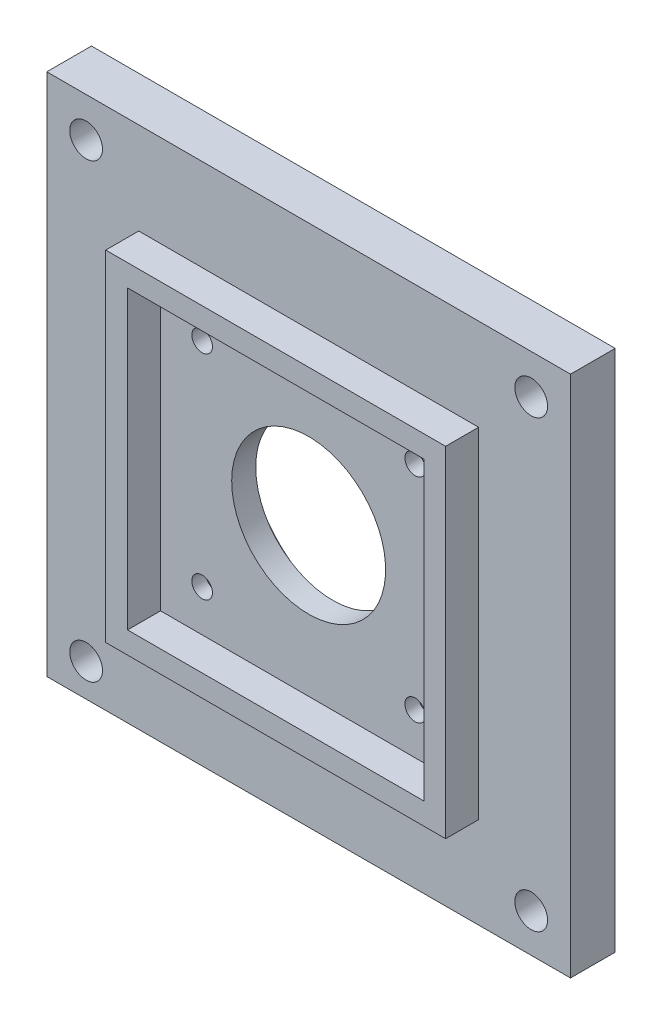
ISO-10303-21;
HEADER;
FILE_DESCRIPTION(('STEP AP214'),'2;1');
FILE_NAME('part.step','',(''),(''),'','','');
FILE_SCHEMA(('AUTOMOTIVE_DESIGN { 1 0 10303 214 1 1 1 1 }'));
ENDSEC;
DATA;
#1=APPLICATION_CONTEXT('core data for automotive mechanical design processes');
#2=APPLICATION_PROTOCOL_DEFINITION('international standard','automotive_design',2000,#1);
#3=PRODUCT_CONTEXT('',#1,'mechanical');
#4=PRODUCT('Part','Part','',(#3));
#5=PRODUCT_RELATED_PRODUCT_CATEGORY('part','',(#4));
#6=PRODUCT_DEFINITION_FORMATION('','',#4);
#7=PRODUCT_DEFINITION_CONTEXT('part definition',#1,'design');
#8=PRODUCT_DEFINITION('design','',#6,#7);
#9=PRODUCT_DEFINITION_SHAPE('','',#8);
#10=(LENGTH_UNIT() NAMED_UNIT(*) SI_UNIT(.MILLI.,.METRE.));
#11=(NAMED_UNIT(*) PLANE_ANGLE_UNIT() SI_UNIT($,.RADIAN.));
#12=(NAMED_UNIT(*) SI_UNIT($,.STERADIAN.) SOLID_ANGLE_UNIT());
#13=UNCERTAINTY_MEASURE_WITH_UNIT(LENGTH_MEASURE(1.E-05),#10,'distance_accuracy_value','');
#14=(GEOMETRIC_REPRESENTATION_CONTEXT(3) GLOBAL_UNCERTAINTY_ASSIGNED_CONTEXT((#13)) GLOBAL_UNIT_ASSIGNED_CONTEXT((#10,
#11,#12)) REPRESENTATION_CONTEXT('',''));
#15=CARTESIAN_POINT('',(0.,0.,0.));
#16=DIRECTION('',(0.,0.,1.));
#17=DIRECTION('',(1.,0.,0.));
#18=AXIS2_PLACEMENT_3D('',#15,#16,#17);
#19=CARTESIAN_POINT('',(-46.55,-4.26952432338381E-13,-6.5));
#20=DIRECTION('',(0.,0.,1.));
#21=DIRECTION('',(1.,0.,0.));
#22=AXIS2_PLACEMENT_3D('',#19,#20,#21);
#23=CYLINDRICAL_SURFACE('',#22,11.2);
#24=CARTESIAN_POINT('',(-46.55,-4.26952432338381E-13,0.));
#25=DIRECTION('',(0.,0.,-1.));
#26=DIRECTION('',(-1.,0.,0.));
#27=AXIS2_PLACEMENT_3D('',#24,#25,#26);
#28=CIRCLE('',#27,11.2);
#29=CARTESIAN_POINT('',(-57.75,-4.26952432338381E-13,0.));
#30=VERTEX_POINT('',#29);
#31=EDGE_CURVE('E137',#30,#30,#28,.T.);
#32=ORIENTED_EDGE('',*,*,#31,.F.);
#33=EDGE_LOOP('',(#32));
#34=FACE_BOUND('',#33,.T.);
#35=CARTESIAN_POINT('',(-46.55,-4.26952432338381E-13,-3.5));
#36=DIRECTION('',(0.,0.,-1.));
#37=DIRECTION('',(-1.,0.,0.));
#38=AXIS2_PLACEMENT_3D('',#35,#36,#37);
#39=CIRCLE('',#38,11.2);
#40=CARTESIAN_POINT('',(-57.75,-4.26952432338381E-13,-3.5));
#41=VERTEX_POINT('',#40);
#42=EDGE_CURVE('E37',#41,#41,#39,.T.);
#43=ORIENTED_EDGE('',*,*,#42,.T.);
#44=EDGE_LOOP('',(#43));
#45=FACE_BOUND('',#44,.T.);
#46=ADVANCED_FACE('F33',(#34,#45),#23,.F.);
#47=CARTESIAN_POINT('',(-31.05,15.4999999999996,-6.5));
#48=DIRECTION('',(0.,0.,1.));
#49=DIRECTION('',(1.,0.,0.));
#50=AXIS2_PLACEMENT_3D('',#47,#48,#49);
#51=CYLINDRICAL_SURFACE('',#50,1.5);
#52=CARTESIAN_POINT('',(-31.05,15.4999999999996,0.));
#53=DIRECTION('',(0.,0.,-1.));
#54=DIRECTION('',(-1.,0.,0.));
#55=AXIS2_PLACEMENT_3D('',#52,#53,#54);
#56=CIRCLE('',#55,1.5);
#57=CARTESIAN_POINT('',(-32.55,15.4999999999996,0.));
#58=VERTEX_POINT('',#57);
#59=EDGE_CURVE('E209',#58,#58,#56,.T.);
#60=ORIENTED_EDGE('',*,*,#59,.F.);
#61=EDGE_LOOP('',(#60));
#62=FACE_BOUND('',#61,.T.);
#63=CARTESIAN_POINT('',(-31.05,15.4999999999996,-3.));
#64=DIRECTION('',(0.,0.,-1.));
#65=DIRECTION('',(-1.,0.,0.));
#66=AXIS2_PLACEMENT_3D('',#63,#64,#65);
#67=CIRCLE('',#66,1.5);
#68=CARTESIAN_POINT('',(-32.55,15.4999999999996,-3.));
#69=VERTEX_POINT('',#68);
#70=EDGE_CURVE('E148',#69,#69,#67,.T.);
#71=ORIENTED_EDGE('',*,*,#70,.T.);
#72=EDGE_LOOP('',(#71));
#73=FACE_BOUND('',#72,.T.);
#74=ADVANCED_FACE('F308',(#62,#73),#51,.F.);
#75=CARTESIAN_POINT('',(-62.05,15.4999999999996,-6.5));
#76=DIRECTION('',(0.,0.,1.));
#77=DIRECTION('',(1.,0.,0.));
#78=AXIS2_PLACEMENT_3D('',#75,#76,#77);
#79=CYLINDRICAL_SURFACE('',#78,1.49999999999999);
#80=CARTESIAN_POINT('',(-62.05,15.4999999999996,0.));
#81=DIRECTION('',(0.,0.,-1.));
#82=DIRECTION('',(-1.,0.,0.));
#83=AXIS2_PLACEMENT_3D('',#80,#81,#82);
#84=CIRCLE('',#83,1.49999999999999);
#85=CARTESIAN_POINT('',(-63.55,15.4999999999996,0.));
#86=VERTEX_POINT('',#85);
#87=EDGE_CURVE('E212',#86,#86,#84,.T.);
#88=ORIENTED_EDGE('',*,*,#87,.F.);
#89=EDGE_LOOP('',(#88));
#90=FACE_BOUND('',#89,.T.);
#91=CARTESIAN_POINT('',(-62.05,15.4999999999996,-3.));
#92=DIRECTION('',(0.,0.,-1.));
#93=DIRECTION('',(-1.,0.,0.));
#94=AXIS2_PLACEMENT_3D('',#91,#92,#93);
#95=CIRCLE('',#94,1.49999999999999);
#96=CARTESIAN_POINT('',(-63.55,15.4999999999996,-3.));
#97=VERTEX_POINT('',#96);
#98=EDGE_CURVE('E144',#97,#97,#95,.T.);
#99=ORIENTED_EDGE('',*,*,#98,.T.);
#100=EDGE_LOOP('',(#99));
#101=FACE_BOUND('',#100,.T.);
#102=ADVANCED_FACE('F314',(#90,#101),#79,.F.);
#103=CARTESIAN_POINT('',(-31.05,-15.5000000000004,-6.5));
#104=DIRECTION('',(0.,0.,1.));
#105=DIRECTION('',(1.,0.,0.));
#106=AXIS2_PLACEMENT_3D('',#103,#104,#105);
#107=CYLINDRICAL_SURFACE('',#106,1.5);
#108=CARTESIAN_POINT('',(-31.05,-15.5000000000004,0.));
#109=DIRECTION('',(0.,0.,-1.));
#110=DIRECTION('',(-1.,0.,0.));
#111=AXIS2_PLACEMENT_3D('',#108,#109,#110);
#112=CIRCLE('',#111,1.5);
#113=CARTESIAN_POINT('',(-32.55,-15.5000000000004,0.));
#114=VERTEX_POINT('',#113);
#115=EDGE_CURVE('E201',#114,#114,#112,.T.);
#116=ORIENTED_EDGE('',*,*,#115,.F.);
#117=EDGE_LOOP('',(#116));
#118=FACE_BOUND('',#117,.T.);
#119=CARTESIAN_POINT('',(-31.05,-15.5000000000004,-2.));
#120=DIRECTION('',(0.,0.,-1.));
#121=DIRECTION('',(-1.,0.,0.));
#122=AXIS2_PLACEMENT_3D('',#119,#120,#121);
#123=CIRCLE('',#122,1.5);
#124=CARTESIAN_POINT('',(-32.55,-15.5000000000004,-2.));
#125=VERTEX_POINT('',#124);
#126=EDGE_CURVE('E139',#125,#125,#123,.T.);
#127=ORIENTED_EDGE('',*,*,#126,.T.);
#128=EDGE_LOOP('',(#127));
#129=FACE_BOUND('',#128,.T.);
#130=ADVANCED_FACE('F340',(#118,#129),#107,.F.);
#131=CARTESIAN_POINT('',(-62.05,-15.5000000000004,-6.5));
#132=DIRECTION('',(0.,0.,1.));
#133=DIRECTION('',(1.,0.,0.));
#134=AXIS2_PLACEMENT_3D('',#131,#132,#133);
#135=CYLINDRICAL_SURFACE('',#134,1.5);
#136=CARTESIAN_POINT('',(-62.05,-15.5000000000004,0.));
#137=DIRECTION('',(0.,0.,-1.));
#138=DIRECTION('',(-1.,0.,0.));
#139=AXIS2_PLACEMENT_3D('',#136,#137,#138);
#140=CIRCLE('',#139,1.5);
#141=CARTESIAN_POINT('',(-63.55,-15.5000000000004,0.));
#142=VERTEX_POINT('',#141);
#143=EDGE_CURVE('E206',#142,#142,#140,.T.);
#144=ORIENTED_EDGE('',*,*,#143,.F.);
#145=EDGE_LOOP('',(#144));
#146=FACE_BOUND('',#145,.T.);
#147=CARTESIAN_POINT('',(-62.05,-15.5000000000004,-2.));
#148=DIRECTION('',(0.,0.,-1.));
#149=DIRECTION('',(-1.,0.,0.));
#150=AXIS2_PLACEMENT_3D('',#147,#148,#149);
#151=CIRCLE('',#150,1.5);
#152=CARTESIAN_POINT('',(-63.55,-15.5000000000004,-2.));
#153=VERTEX_POINT('',#152);
#154=EDGE_CURVE('E134',#153,#153,#151,.T.);
#155=ORIENTED_EDGE('',*,*,#154,.T.);
#156=EDGE_LOOP('',(#155));
#157=FACE_BOUND('',#156,.T.);
#158=ADVANCED_FACE('F343',(#146,#157),#135,.F.);
#159=CARTESIAN_POINT('',(-21.825,24.7249999999995,4.8));
#160=DIRECTION('',(0.,0.,-1.));
#161=DIRECTION('',(-1.,0.,0.));
#162=AXIS2_PLACEMENT_3D('',#159,#160,#161);
#163=PLANE('',#162);
#164=DIRECTION('',(-1.,0.,0.));
#165=VECTOR('',#164,1.);
#166=CARTESIAN_POINT('',(-71.275,24.7249999999995,4.8));
#167=LINE('',#166,#165);
#168=CARTESIAN_POINT('',(-21.825,24.7249999999995,4.8));
#169=VERTEX_POINT('',#168);
#170=CARTESIAN_POINT('',(-71.275,24.7249999999995,4.8));
#171=VERTEX_POINT('',#170);
#172=EDGE_CURVE('E104',#169,#171,#167,.T.);
#173=ORIENTED_EDGE('',*,*,#172,.T.);
#174=DIRECTION('',(0.,-1.,0.));
#175=VECTOR('',#174,1.);
#176=CARTESIAN_POINT('',(-71.275,-24.7250000000005,4.8));
#177=LINE('',#176,#175);
#178=CARTESIAN_POINT('',(-71.275,-24.7250000000005,4.8));
#179=VERTEX_POINT('',#178);
#180=EDGE_CURVE('E96',#171,#179,#177,.T.);
#181=ORIENTED_EDGE('',*,*,#180,.T.);
#182=DIRECTION('',(1.,0.,0.));
#183=VECTOR('',#182,1.);
#184=CARTESIAN_POINT('',(-21.825,-24.7250000000004,4.8));
#185=LINE('',#184,#183);
#186=CARTESIAN_POINT('',(-21.825,-24.7250000000004,4.8));
#187=VERTEX_POINT('',#186);
#188=EDGE_CURVE('E101',#179,#187,#185,.T.);
#189=ORIENTED_EDGE('',*,*,#188,.T.);
#190=DIRECTION('',(0.,1.,0.));
#191=VECTOR('',#190,1.);
#192=CARTESIAN_POINT('',(-21.825,24.7249999999995,4.8));
#193=LINE('',#192,#191);
#194=EDGE_CURVE('E59',#187,#169,#193,.T.);
#195=ORIENTED_EDGE('',*,*,#194,.T.);
#196=EDGE_LOOP('',(#173,#181,#189,#195));
#197=FACE_BOUND('',#196,.T.);
#198=DIRECTION('',(1.,0.,0.));
#199=VECTOR('',#198,1.);
#200=CARTESIAN_POINT('',(-68.1,-21.5500000000005,4.8));
#201=LINE('',#200,#199);
#202=CARTESIAN_POINT('',(-68.1,-21.5500000000005,4.8));
#203=VERTEX_POINT('',#202);
#204=CARTESIAN_POINT('',(-25.,-21.5500000000004,4.8));
#205=VERTEX_POINT('',#204);
#206=EDGE_CURVE('E252',#203,#205,#201,.T.);
#207=ORIENTED_EDGE('',*,*,#206,.F.);
#208=DIRECTION('',(0.,-1.,0.));
#209=VECTOR('',#208,1.);
#210=CARTESIAN_POINT('',(-68.1,21.5499999999995,4.8));
#211=LINE('',#210,#209);
#212=CARTESIAN_POINT('',(-68.1,21.5499999999995,4.8));
#213=VERTEX_POINT('',#212);
#214=EDGE_CURVE('E80',#213,#203,#211,.T.);
#215=ORIENTED_EDGE('',*,*,#214,.F.);
#216=DIRECTION('',(-1.,0.,0.));
#217=VECTOR('',#216,1.);
#218=CARTESIAN_POINT('',(-25.,21.5499999999995,4.8));
#219=LINE('',#218,#217);
#220=CARTESIAN_POINT('',(-25.,21.5499999999995,4.8));
#221=VERTEX_POINT('',#220);
#222=EDGE_CURVE('E258',#221,#213,#219,.T.);
#223=ORIENTED_EDGE('',*,*,#222,.F.);
#224=DIRECTION('',(0.,1.,0.));
#225=VECTOR('',#224,1.);
#226=CARTESIAN_POINT('',(-25.,-21.5500000000004,4.8));
#227=LINE('',#226,#225);
#228=EDGE_CURVE('E255',#205,#221,#227,.T.);
#229=ORIENTED_EDGE('',*,*,#228,.F.);
#230=EDGE_LOOP('',(#207,#215,#223,#229));
#231=FACE_BOUND('',#230,.T.);
#232=ADVANCED_FACE('F98',(#197,#231),#163,.F.);
#233=CARTESIAN_POINT('',(-71.275,24.7249999999995,4.8));
#234=DIRECTION('',(0.,-1.,0.));
#235=DIRECTION('',(1.,0.,0.));
#236=AXIS2_PLACEMENT_3D('',#233,#234,#235);
#237=PLANE('',#236);
#238=DIRECTION('',(-1.,0.,0.));
#239=VECTOR('',#238,1.);
#240=CARTESIAN_POINT('',(-71.275,24.7249999999995,0.));
#241=LINE('',#240,#239);
#242=CARTESIAN_POINT('',(-21.825,24.7249999999995,0.));
#243=VERTEX_POINT('',#242);
#244=CARTESIAN_POINT('',(-71.275,24.7249999999995,0.));
#245=VERTEX_POINT('',#244);
#246=EDGE_CURVE('E72',#243,#245,#241,.T.);
#247=ORIENTED_EDGE('',*,*,#246,.T.);
#248=DIRECTION('',(0.,0.,-1.));
#249=VECTOR('',#248,1.);
#250=CARTESIAN_POINT('',(-71.275,24.7249999999995,4.8));
#251=LINE('',#250,#249);
#252=EDGE_CURVE('E11',#171,#245,#251,.T.);
#253=ORIENTED_EDGE('',*,*,#252,.F.);
#254=ORIENTED_EDGE('',*,*,#172,.F.);
#255=DIRECTION('',(0.,0.,-1.));
#256=VECTOR('',#255,1.);
#257=CARTESIAN_POINT('',(-21.825,24.7249999999995,4.8));
#258=LINE('',#257,#256);
#259=EDGE_CURVE('E120',#169,#243,#258,.T.);
#260=ORIENTED_EDGE('',*,*,#259,.T.);
#261=EDGE_LOOP('',(#247,#253,#254,#260));
#262=FACE_BOUND('',#261,.T.);
#263=ADVANCED_FACE('F35',(#262),#237,.F.);
#264=CARTESIAN_POINT('',(-71.275,-24.7250000000005,4.8));
#265=DIRECTION('',(1.,0.,0.));
#266=DIRECTION('',(0.,1.,0.));
#267=AXIS2_PLACEMENT_3D('',#264,#265,#266);
#268=PLANE('',#267);
#269=DIRECTION('',(0.,-1.,0.));
#270=VECTOR('',#269,1.);
#271=CARTESIAN_POINT('',(-71.275,-24.7250000000005,0.));
#272=LINE('',#271,#270);
#273=CARTESIAN_POINT('',(-71.275,-24.7250000000005,0.));
#274=VERTEX_POINT('',#273);
#275=EDGE_CURVE('E112',#245,#274,#272,.T.);
#276=ORIENTED_EDGE('',*,*,#275,.T.);
#277=DIRECTION('',(0.,0.,-1.));
#278=VECTOR('',#277,1.);
#279=CARTESIAN_POINT('',(-71.275,-24.7250000000005,4.8));
#280=LINE('',#279,#278);
#281=EDGE_CURVE('E42',#179,#274,#280,.T.);
#282=ORIENTED_EDGE('',*,*,#281,.F.);
#283=ORIENTED_EDGE('',*,*,#180,.F.);
#284=ORIENTED_EDGE('',*,*,#252,.T.);
#285=EDGE_LOOP('',(#276,#282,#283,#284));
#286=FACE_BOUND('',#285,.T.);
#287=ADVANCED_FACE('F110',(#286),#268,.F.);
#288=CARTESIAN_POINT('',(-21.825,-24.7250000000004,4.8));
#289=DIRECTION('',(0.,1.,0.));
#290=DIRECTION('',(-1.,0.,0.));
#291=AXIS2_PLACEMENT_3D('',#288,#289,#290);
#292=PLANE('',#291);
#293=DIRECTION('',(1.,0.,0.));
#294=VECTOR('',#293,1.);
#295=CARTESIAN_POINT('',(-21.825,-24.7250000000004,0.));
#296=LINE('',#295,#294);
#297=CARTESIAN_POINT('',(-21.825,-24.7250000000004,0.));
#298=VERTEX_POINT('',#297);
#299=EDGE_CURVE('E127',#274,#298,#296,.T.);
#300=ORIENTED_EDGE('',*,*,#299,.T.);
#301=DIRECTION('',(0.,0.,-1.));
#302=VECTOR('',#301,1.);
#303=CARTESIAN_POINT('',(-21.825,-24.7250000000004,4.8));
#304=LINE('',#303,#302);
#305=EDGE_CURVE('E115',#187,#298,#304,.T.);
#306=ORIENTED_EDGE('',*,*,#305,.F.);
#307=ORIENTED_EDGE('',*,*,#188,.F.);
#308=ORIENTED_EDGE('',*,*,#281,.T.);
#309=EDGE_LOOP('',(#300,#306,#307,#308));
#310=FACE_BOUND('',#309,.T.);
#311=ADVANCED_FACE('F117',(#310),#292,.F.);
#312=CARTESIAN_POINT('',(-21.825,24.7249999999995,4.8));
#313=DIRECTION('',(-1.,0.,0.));
#314=DIRECTION('',(0.,-1.,0.));
#315=AXIS2_PLACEMENT_3D('',#312,#313,#314);
#316=PLANE('',#315);
#317=DIRECTION('',(0.,1.,0.));
#318=VECTOR('',#317,1.);
#319=CARTESIAN_POINT('',(-21.825,24.7249999999995,0.));
#320=LINE('',#319,#318);
#321=EDGE_CURVE('E129',#298,#243,#320,.T.);
#322=ORIENTED_EDGE('',*,*,#321,.T.);
#323=ORIENTED_EDGE('',*,*,#259,.F.);
#324=ORIENTED_EDGE('',*,*,#194,.F.);
#325=ORIENTED_EDGE('',*,*,#305,.T.);
#326=EDGE_LOOP('',(#322,#323,#324,#325));
#327=FACE_BOUND('',#326,.T.);
#328=ADVANCED_FACE('F400',(#327),#316,.F.);
#329=CARTESIAN_POINT('',(-68.1,-21.5500000000005,4.8));
#330=DIRECTION('',(0.,1.,0.));
#331=DIRECTION('',(-1.,0.,0.));
#332=AXIS2_PLACEMENT_3D('',#329,#330,#331);
#333=PLANE('',#332);
#334=DIRECTION('',(1.,0.,0.));
#335=VECTOR('',#334,1.);
#336=CARTESIAN_POINT('',(-68.1,-21.5500000000005,0.));
#337=LINE('',#336,#335);
#338=CARTESIAN_POINT('',(-68.1,-21.5500000000005,0.));
#339=VERTEX_POINT('',#338);
#340=CARTESIAN_POINT('',(-25.,-21.5500000000004,0.));
#341=VERTEX_POINT('',#340);
#342=EDGE_CURVE('E251',#339,#341,#337,.T.);
#343=ORIENTED_EDGE('',*,*,#342,.F.);
#344=DIRECTION('',(0.,0.,-1.));
#345=VECTOR('',#344,1.);
#346=CARTESIAN_POINT('',(-68.1,-21.5500000000005,4.8));
#347=LINE('',#346,#345);
#348=EDGE_CURVE('E261',#203,#339,#347,.T.);
#349=ORIENTED_EDGE('',*,*,#348,.F.);
#350=ORIENTED_EDGE('',*,*,#206,.T.);
#351=DIRECTION('',(0.,0.,-1.));
#352=VECTOR('',#351,1.);
#353=CARTESIAN_POINT('',(-25.,-21.5500000000004,4.8));
#354=LINE('',#353,#352);
#355=EDGE_CURVE('E125',#205,#341,#354,.T.);
#356=ORIENTED_EDGE('',*,*,#355,.T.);
#357=EDGE_LOOP('',(#343,#349,#350,#356));
#358=FACE_BOUND('',#357,.T.);
#359=ADVANCED_FACE('F280',(#358),#333,.T.);
#360=CARTESIAN_POINT('',(-25.,-21.5500000000004,4.8));
#361=DIRECTION('',(-1.,0.,0.));
#362=DIRECTION('',(0.,0.,1.));
#363=AXIS2_PLACEMENT_3D('',#360,#361,#362);
#364=PLANE('',#363);
#365=DIRECTION('',(0.,1.,0.));
#366=VECTOR('',#365,1.);
#367=CARTESIAN_POINT('',(-25.,-21.5500000000004,0.));
#368=LINE('',#367,#366);
#369=CARTESIAN_POINT('',(-25.,21.5499999999995,0.));
#370=VERTEX_POINT('',#369);
#371=EDGE_CURVE('E264',#341,#370,#368,.T.);
#372=ORIENTED_EDGE('',*,*,#371,.F.);
#373=ORIENTED_EDGE('',*,*,#355,.F.);
#374=ORIENTED_EDGE('',*,*,#228,.T.);
#375=DIRECTION('',(0.,0.,-1.));
#376=VECTOR('',#375,1.);
#377=CARTESIAN_POINT('',(-25.,21.5499999999995,4.8));
#378=LINE('',#377,#376);
#379=EDGE_CURVE('E274',#221,#370,#378,.T.);
#380=ORIENTED_EDGE('',*,*,#379,.T.);
#381=EDGE_LOOP('',(#372,#373,#374,#380));
#382=FACE_BOUND('',#381,.T.);
#383=ADVANCED_FACE('F295',(#382),#364,.T.);
#384=CARTESIAN_POINT('',(-25.,21.5499999999995,4.8));
#385=DIRECTION('',(0.,-1.,0.));
#386=DIRECTION('',(1.,0.,0.));
#387=AXIS2_PLACEMENT_3D('',#384,#385,#386);
#388=PLANE('',#387);
#389=DIRECTION('',(-1.,0.,0.));
#390=VECTOR('',#389,1.);
#391=CARTESIAN_POINT('',(-25.,21.5499999999995,0.));
#392=LINE('',#391,#390);
#393=CARTESIAN_POINT('',(-68.1,21.5499999999995,0.));
#394=VERTEX_POINT('',#393);
#395=EDGE_CURVE('E267',#370,#394,#392,.T.);
#396=ORIENTED_EDGE('',*,*,#395,.F.);
#397=ORIENTED_EDGE('',*,*,#379,.F.);
#398=ORIENTED_EDGE('',*,*,#222,.T.);
#399=DIRECTION('',(0.,0.,-1.));
#400=VECTOR('',#399,1.);
#401=CARTESIAN_POINT('',(-68.1,21.5499999999995,4.8));
#402=LINE('',#401,#400);
#403=EDGE_CURVE('E50',#213,#394,#402,.T.);
#404=ORIENTED_EDGE('',*,*,#403,.T.);
#405=EDGE_LOOP('',(#396,#397,#398,#404));
#406=FACE_BOUND('',#405,.T.);
#407=ADVANCED_FACE('F297',(#406),#388,.T.);
#408=CARTESIAN_POINT('',(-68.1,21.5499999999995,4.8));
#409=DIRECTION('',(1.,0.,0.));
#410=DIRECTION('',(0.,0.,-1.));
#411=AXIS2_PLACEMENT_3D('',#408,#409,#410);
#412=PLANE('',#411);
#413=DIRECTION('',(0.,-1.,0.));
#414=VECTOR('',#413,1.);
#415=CARTESIAN_POINT('',(-68.1,21.5499999999995,0.));
#416=LINE('',#415,#414);
#417=EDGE_CURVE('E256',#394,#339,#416,.T.);
#418=ORIENTED_EDGE('',*,*,#417,.F.);
#419=ORIENTED_EDGE('',*,*,#403,.F.);
#420=ORIENTED_EDGE('',*,*,#214,.T.);
#421=ORIENTED_EDGE('',*,*,#348,.T.);
#422=EDGE_LOOP('',(#418,#419,#420,#421));
#423=FACE_BOUND('',#422,.T.);
#424=ADVANCED_FACE('F292',(#423),#412,.T.);
#425=CARTESIAN_POINT('',(-8.44999999999996,38.0999999999996,0.));
#426=DIRECTION('',(0.,0.,-1.));
#427=DIRECTION('',(-1.,0.,0.));
#428=AXIS2_PLACEMENT_3D('',#425,#426,#427);
#429=PLANE('',#428);
#430=CARTESIAN_POINT('',(-14.17,-32.3800000000004,0.));
#431=DIRECTION('',(0.,0.,-1.));
#432=DIRECTION('',(-1.,0.,0.));
#433=AXIS2_PLACEMENT_3D('',#430,#431,#432);
#434=CIRCLE('',#433,2.38125);
#435=CARTESIAN_POINT('',(-16.55125,-32.3800000000004,0.));
#436=VERTEX_POINT('',#435);
#437=EDGE_CURVE('E179',#436,#436,#434,.T.);
#438=ORIENTED_EDGE('',*,*,#437,.T.);
#439=EDGE_LOOP('',(#438));
#440=FACE_BOUND('',#439,.T.);
#441=CARTESIAN_POINT('',(-78.93,32.3799999999996,0.));
#442=DIRECTION('',(0.,0.,-1.));
#443=DIRECTION('',(-1.,0.,0.));
#444=AXIS2_PLACEMENT_3D('',#441,#442,#443);
#445=CIRCLE('',#444,2.38125);
#446=CARTESIAN_POINT('',(-81.31125,32.3799999999996,0.));
#447=VERTEX_POINT('',#446);
#448=EDGE_CURVE('E189',#447,#447,#445,.T.);
#449=ORIENTED_EDGE('',*,*,#448,.T.);
#450=EDGE_LOOP('',(#449));
#451=FACE_BOUND('',#450,.T.);
#452=DIRECTION('',(1.,0.,0.));
#453=VECTOR('',#452,1.);
#454=CARTESIAN_POINT('',(-84.65,38.0999999999996,0.));
#455=LINE('',#454,#453);
#456=CARTESIAN_POINT('',(-84.65,38.0999999999996,0.));
#457=VERTEX_POINT('',#456);
#458=CARTESIAN_POINT('',(-8.44999999999996,38.0999999999996,0.));
#459=VERTEX_POINT('',#458);
#460=EDGE_CURVE('E215',#457,#459,#455,.T.);
#461=ORIENTED_EDGE('',*,*,#460,.F.);
#462=DIRECTION('',(0.,1.,0.));
#463=VECTOR('',#462,1.);
#464=CARTESIAN_POINT('',(-84.65,-38.1000000000004,0.));
#465=LINE('',#464,#463);
#466=CARTESIAN_POINT('',(-84.65,-38.1000000000004,0.));
#467=VERTEX_POINT('',#466);
#468=EDGE_CURVE('E220',#467,#457,#465,.T.);
#469=ORIENTED_EDGE('',*,*,#468,.F.);
#470=DIRECTION('',(-0.999998900596113,-0.001482837335923,0.));
#471=VECTOR('',#470,1.);
#472=CARTESIAN_POINT('',(-8.45,-37.9870076707789,0.));
#473=LINE('',#472,#471);
#474=CARTESIAN_POINT('',(-8.45,-37.9870076707789,0.));
#475=VERTEX_POINT('',#474);
#476=EDGE_CURVE('E235',#475,#467,#473,.T.);
#477=ORIENTED_EDGE('',*,*,#476,.F.);
#478=DIRECTION('',(0.,-1.,0.));
#479=VECTOR('',#478,1.);
#480=CARTESIAN_POINT('',(-8.44999999999996,38.0999999999996,0.));
#481=LINE('',#480,#479);
#482=EDGE_CURVE('E232',#459,#475,#481,.T.);
#483=ORIENTED_EDGE('',*,*,#482,.F.);
#484=EDGE_LOOP('',(#461,#469,#477,#483));
#485=FACE_BOUND('',#484,.T.);
#486=CARTESIAN_POINT('',(-14.17,32.3799999999996,0.));
#487=DIRECTION('',(0.,0.,-1.));
#488=DIRECTION('',(-1.,0.,0.));
#489=AXIS2_PLACEMENT_3D('',#486,#487,#488);
#490=CIRCLE('',#489,2.38125);
#491=CARTESIAN_POINT('',(-16.55125,32.3799999999996,0.));
#492=VERTEX_POINT('',#491);
#493=EDGE_CURVE('E195',#492,#492,#490,.T.);
#494=ORIENTED_EDGE('',*,*,#493,.T.);
#495=EDGE_LOOP('',(#494));
#496=FACE_BOUND('',#495,.T.);
#497=CARTESIAN_POINT('',(-78.93,-33.3093949292618,0.));
#498=DIRECTION('',(0.,0.,-1.));
#499=DIRECTION('',(-1.,0.,0.));
#500=AXIS2_PLACEMENT_3D('',#497,#498,#499);
#501=CIRCLE('',#500,2.38125);
#502=CARTESIAN_POINT('',(-81.31125,-33.3093949292618,0.));
#503=VERTEX_POINT('',#502);
#504=EDGE_CURVE('E183',#503,#503,#501,.T.);
#505=ORIENTED_EDGE('',*,*,#504,.T.);
#506=EDGE_LOOP('',(#505));
#507=FACE_BOUND('',#506,.T.);
#508=ORIENTED_EDGE('',*,*,#275,.F.);
#509=ORIENTED_EDGE('',*,*,#246,.F.);
#510=ORIENTED_EDGE('',*,*,#321,.F.);
#511=ORIENTED_EDGE('',*,*,#299,.F.);
#512=EDGE_LOOP('',(#508,#509,#510,#511));
#513=FACE_BOUND('',#512,.T.);
#514=ADVANCED_FACE('F304',(#440,#451,#485,#496,#507,#513),#429,.F.);
#515=CARTESIAN_POINT('',(-8.44999999999996,38.0999999999996,-6.5));
#516=DIRECTION('',(0.,0.,-1.));
#517=DIRECTION('',(-1.,0.,0.));
#518=AXIS2_PLACEMENT_3D('',#515,#516,#517);
#519=PLANE('',#518);
#520=CARTESIAN_POINT('',(-46.55,-4.19803081186387E-13,-6.5));
#521=DIRECTION('',(0.,0.,-1.));
#522=DIRECTION('',(-1.,0.,0.));
#523=AXIS2_PLACEMENT_3D('',#520,#521,#522);
#524=CIRCLE('',#523,15.3625);
#525=CARTESIAN_POINT('',(-61.9125,-4.19803081186387E-13,-6.5));
#526=VERTEX_POINT('',#525);
#527=EDGE_CURVE('E164',#526,#526,#524,.T.);
#528=ORIENTED_EDGE('',*,*,#527,.F.);
#529=EDGE_LOOP('',(#528));
#530=FACE_BOUND('',#529,.T.);
#531=CARTESIAN_POINT('',(-31.05,15.4999999999996,-6.5));
#532=DIRECTION('',(0.,0.,-1.));
#533=DIRECTION('',(-1.,0.,0.));
#534=AXIS2_PLACEMENT_3D('',#531,#532,#533);
#535=CIRCLE('',#534,5.99999999999999);
#536=CARTESIAN_POINT('',(-37.05,15.4999999999996,-6.5));
#537=VERTEX_POINT('',#536);
#538=EDGE_CURVE('E157',#537,#537,#535,.T.);
#539=ORIENTED_EDGE('',*,*,#538,.F.);
#540=EDGE_LOOP('',(#539));
#541=FACE_BOUND('',#540,.T.);
#542=CARTESIAN_POINT('',(-62.05,15.4999999999996,-6.5));
#543=DIRECTION('',(0.,0.,-1.));
#544=DIRECTION('',(-1.,0.,0.));
#545=AXIS2_PLACEMENT_3D('',#542,#543,#544);
#546=CIRCLE('',#545,5.99999999999999);
#547=CARTESIAN_POINT('',(-68.05,15.4999999999996,-6.5));
#548=VERTEX_POINT('',#547);
#549=EDGE_CURVE('E150',#548,#548,#546,.T.);
#550=ORIENTED_EDGE('',*,*,#549,.F.);
#551=EDGE_LOOP('',(#550));
#552=FACE_BOUND('',#551,.T.);
#553=CARTESIAN_POINT('',(-31.05,-15.5000000000004,-6.5));
#554=DIRECTION('',(0.,0.,-1.));
#555=DIRECTION('',(-1.,0.,0.));
#556=AXIS2_PLACEMENT_3D('',#553,#554,#555);
#557=CIRCLE('',#556,6.);
#558=CARTESIAN_POINT('',(-37.05,-15.5000000000004,-6.5));
#559=VERTEX_POINT('',#558);
#560=EDGE_CURVE('E146',#559,#559,#557,.T.);
#561=ORIENTED_EDGE('',*,*,#560,.F.);
#562=EDGE_LOOP('',(#561));
#563=FACE_BOUND('',#562,.T.);
#564=CARTESIAN_POINT('',(-62.05,-15.5000000000004,-6.5));
#565=DIRECTION('',(0.,0.,-1.));
#566=DIRECTION('',(-1.,0.,0.));
#567=AXIS2_PLACEMENT_3D('',#564,#565,#566);
#568=CIRCLE('',#567,6.);
#569=CARTESIAN_POINT('',(-68.05,-15.5000000000004,-6.5));
#570=VERTEX_POINT('',#569);
#571=EDGE_CURVE('E142',#570,#570,#568,.T.);
#572=ORIENTED_EDGE('',*,*,#571,.F.);
#573=EDGE_LOOP('',(#572));
#574=FACE_BOUND('',#573,.T.);
#575=CARTESIAN_POINT('',(-14.17,-32.3800000000004,-6.5));
#576=DIRECTION('',(0.,0.,-1.));
#577=DIRECTION('',(-1.,0.,0.));
#578=AXIS2_PLACEMENT_3D('',#575,#576,#577);
#579=CIRCLE('',#578,2.38125);
#580=CARTESIAN_POINT('',(-16.55125,-32.3800000000004,-6.5));
#581=VERTEX_POINT('',#580);
#582=EDGE_CURVE('E180',#581,#581,#579,.T.);
#583=ORIENTED_EDGE('',*,*,#582,.F.);
#584=EDGE_LOOP('',(#583));
#585=FACE_BOUND('',#584,.T.);
#586=CARTESIAN_POINT('',(-78.93,32.3799999999996,-6.5));
#587=DIRECTION('',(0.,0.,-1.));
#588=DIRECTION('',(-1.,0.,0.));
#589=AXIS2_PLACEMENT_3D('',#586,#587,#588);
#590=CIRCLE('',#589,2.38125);
#591=CARTESIAN_POINT('',(-81.31125,32.3799999999996,-6.5));
#592=VERTEX_POINT('',#591);
#593=EDGE_CURVE('E192',#592,#592,#590,.T.);
#594=ORIENTED_EDGE('',*,*,#593,.F.);
#595=EDGE_LOOP('',(#594));
#596=FACE_BOUND('',#595,.T.);
#597=DIRECTION('',(1.,0.,0.));
#598=VECTOR('',#597,1.);
#599=CARTESIAN_POINT('',(-84.65,38.0999999999996,-6.5));
#600=LINE('',#599,#598);
#601=CARTESIAN_POINT('',(-84.65,38.0999999999996,-6.5));
#602=VERTEX_POINT('',#601);
#603=CARTESIAN_POINT('',(-8.44999999999996,38.0999999999996,-6.5));
#604=VERTEX_POINT('',#603);
#605=EDGE_CURVE('E216',#602,#604,#600,.T.);
#606=ORIENTED_EDGE('',*,*,#605,.T.);
#607=DIRECTION('',(0.,-1.,0.));
#608=VECTOR('',#607,1.);
#609=CARTESIAN_POINT('',(-8.44999999999996,38.0999999999996,-6.5));
#610=LINE('',#609,#608);
#611=CARTESIAN_POINT('',(-8.45,-37.9870076707789,-6.5));
#612=VERTEX_POINT('',#611);
#613=EDGE_CURVE('E219',#604,#612,#610,.T.);
#614=ORIENTED_EDGE('',*,*,#613,.T.);
#615=DIRECTION('',(-0.999998900596113,-0.001482837335923,0.));
#616=VECTOR('',#615,1.);
#617=CARTESIAN_POINT('',(-8.45,-37.9870076707789,-6.5));
#618=LINE('',#617,#616);
#619=CARTESIAN_POINT('',(-84.65,-38.1000000000004,-6.5));
#620=VERTEX_POINT('',#619);
#621=EDGE_CURVE('E223',#612,#620,#618,.T.);
#622=ORIENTED_EDGE('',*,*,#621,.T.);
#623=DIRECTION('',(0.,1.,0.));
#624=VECTOR('',#623,1.);
#625=CARTESIAN_POINT('',(-84.65,-38.1000000000004,-6.5));
#626=LINE('',#625,#624);
#627=EDGE_CURVE('E226',#620,#602,#626,.T.);
#628=ORIENTED_EDGE('',*,*,#627,.T.);
#629=EDGE_LOOP('',(#606,#614,#622,#628));
#630=FACE_BOUND('',#629,.T.);
#631=CARTESIAN_POINT('',(-14.17,32.3799999999996,-6.5));
#632=DIRECTION('',(0.,0.,-1.));
#633=DIRECTION('',(-1.,0.,0.));
#634=AXIS2_PLACEMENT_3D('',#631,#632,#633);
#635=CIRCLE('',#634,2.38125);
#636=CARTESIAN_POINT('',(-16.55125,32.3799999999996,-6.5));
#637=VERTEX_POINT('',#636);
#638=EDGE_CURVE('E198',#637,#637,#635,.T.);
#639=ORIENTED_EDGE('',*,*,#638,.F.);
#640=EDGE_LOOP('',(#639));
#641=FACE_BOUND('',#640,.T.);
#642=CARTESIAN_POINT('',(-78.93,-33.3093949292618,-6.5));
#643=DIRECTION('',(0.,0.,-1.));
#644=DIRECTION('',(-1.,0.,0.));
#645=AXIS2_PLACEMENT_3D('',#642,#643,#644);
#646=CIRCLE('',#645,2.38125);
#647=CARTESIAN_POINT('',(-81.31125,-33.3093949292618,-6.5));
#648=VERTEX_POINT('',#647);
#649=EDGE_CURVE('E186',#648,#648,#646,.T.);
#650=ORIENTED_EDGE('',*,*,#649,.F.);
#651=EDGE_LOOP('',(#650));
#652=FACE_BOUND('',#651,.T.);
#653=ADVANCED_FACE('F351',(#530,#541,#552,#563,#574,#585,#596,#630,#641,#652),#519,.T.);
#654=ORIENTED_EDGE('',*,*,#342,.T.);
#655=ORIENTED_EDGE('',*,*,#371,.T.);
#656=ORIENTED_EDGE('',*,*,#395,.T.);
#657=ORIENTED_EDGE('',*,*,#417,.T.);
#658=EDGE_LOOP('',(#654,#655,#656,#657));
#659=FACE_BOUND('',#658,.T.);
#660=ORIENTED_EDGE('',*,*,#115,.T.);
#661=EDGE_LOOP('',(#660));
#662=FACE_BOUND('',#661,.T.);
#663=ORIENTED_EDGE('',*,*,#59,.T.);
#664=EDGE_LOOP('',(#663));
#665=FACE_BOUND('',#664,.T.);
#666=ORIENTED_EDGE('',*,*,#87,.T.);
#667=EDGE_LOOP('',(#666));
#668=FACE_BOUND('',#667,.T.);
#669=ORIENTED_EDGE('',*,*,#143,.T.);
#670=EDGE_LOOP('',(#669));
#671=FACE_BOUND('',#670,.T.);
#672=ORIENTED_EDGE('',*,*,#31,.T.);
#673=EDGE_LOOP('',(#672));
#674=FACE_BOUND('',#673,.T.);
#675=ADVANCED_FACE('F286',(#659,#662,#665,#668,#671,#674),#429,.F.);
#676=CARTESIAN_POINT('',(-84.65,38.0999999999996,-6.5));
#677=DIRECTION('',(0.,-1.,0.));
#678=DIRECTION('',(1.,0.,0.));
#679=AXIS2_PLACEMENT_3D('',#676,#677,#678);
#680=PLANE('',#679);
#681=ORIENTED_EDGE('',*,*,#460,.T.);
#682=DIRECTION('',(0.,0.,1.));
#683=VECTOR('',#682,1.);
#684=CARTESIAN_POINT('',(-8.44999999999996,38.0999999999996,-6.5));
#685=LINE('',#684,#683);
#686=EDGE_CURVE('E248',#604,#459,#685,.T.);
#687=ORIENTED_EDGE('',*,*,#686,.F.);
#688=ORIENTED_EDGE('',*,*,#605,.F.);
#689=DIRECTION('',(0.,0.,1.));
#690=VECTOR('',#689,1.);
#691=CARTESIAN_POINT('',(-84.65,38.0999999999996,-6.5));
#692=LINE('',#691,#690);
#693=EDGE_CURVE('E229',#602,#457,#692,.T.);
#694=ORIENTED_EDGE('',*,*,#693,.T.);
#695=EDGE_LOOP('',(#681,#687,#688,#694));
#696=FACE_BOUND('',#695,.T.);
#697=ADVANCED_FACE('F357',(#696),#680,.F.);
#698=CARTESIAN_POINT('',(-8.44999999999996,38.0999999999996,-6.5));
#699=DIRECTION('',(-1.,0.,0.));
#700=DIRECTION('',(0.,-1.,0.));
#701=AXIS2_PLACEMENT_3D('',#698,#699,#700);
#702=PLANE('',#701);
#703=ORIENTED_EDGE('',*,*,#482,.T.);
#704=DIRECTION('',(0.,0.,1.));
#705=VECTOR('',#704,1.);
#706=CARTESIAN_POINT('',(-8.45,-37.9870076707789,-6.5));
#707=LINE('',#706,#705);
#708=EDGE_CURVE('E245',#612,#475,#707,.T.);
#709=ORIENTED_EDGE('',*,*,#708,.F.);
#710=ORIENTED_EDGE('',*,*,#613,.F.);
#711=ORIENTED_EDGE('',*,*,#686,.T.);
#712=EDGE_LOOP('',(#703,#709,#710,#711));
#713=FACE_BOUND('',#712,.T.);
#714=ADVANCED_FACE('F364',(#713),#702,.F.);
#715=CARTESIAN_POINT('',(-8.45,-37.9870076707789,-6.5));
#716=DIRECTION('',(-0.001482837335923,0.999998900596113,0.));
#717=DIRECTION('',(-0.999998900596113,-0.001482837335923,0.));
#718=AXIS2_PLACEMENT_3D('',#715,#716,#717);
#719=PLANE('',#718);
#720=ORIENTED_EDGE('',*,*,#476,.T.);
#721=DIRECTION('',(0.,0.,1.));
#722=VECTOR('',#721,1.);
#723=CARTESIAN_POINT('',(-84.65,-38.1000000000004,-6.5));
#724=LINE('',#723,#722);
#725=EDGE_CURVE('E242',#620,#467,#724,.T.);
#726=ORIENTED_EDGE('',*,*,#725,.F.);
#727=ORIENTED_EDGE('',*,*,#621,.F.);
#728=ORIENTED_EDGE('',*,*,#708,.T.);
#729=EDGE_LOOP('',(#720,#726,#727,#728));
#730=FACE_BOUND('',#729,.T.);
#731=ADVANCED_FACE('F360',(#730),#719,.F.);
#732=CARTESIAN_POINT('',(-84.65,-38.1000000000004,-6.5));
#733=DIRECTION('',(1.,0.,0.));
#734=DIRECTION('',(0.,0.,-1.));
#735=AXIS2_PLACEMENT_3D('',#732,#733,#734);
#736=PLANE('',#735);
#737=ORIENTED_EDGE('',*,*,#468,.T.);
#738=ORIENTED_EDGE('',*,*,#693,.F.);
#739=ORIENTED_EDGE('',*,*,#627,.F.);
#740=ORIENTED_EDGE('',*,*,#725,.T.);
#741=EDGE_LOOP('',(#737,#738,#739,#740));
#742=FACE_BOUND('',#741,.T.);
#743=ADVANCED_FACE('F338',(#742),#736,.F.);
#744=CARTESIAN_POINT('',(-14.17,32.3799999999996,-6.5));
#745=DIRECTION('',(0.,0.,1.));
#746=DIRECTION('',(1.,0.,0.));
#747=AXIS2_PLACEMENT_3D('',#744,#745,#746);
#748=CYLINDRICAL_SURFACE('',#747,2.38125);
#749=ORIENTED_EDGE('',*,*,#638,.T.);
#750=EDGE_LOOP('',(#749));
#751=FACE_BOUND('',#750,.T.);
#752=ORIENTED_EDGE('',*,*,#493,.F.);
#753=EDGE_LOOP('',(#752));
#754=FACE_BOUND('',#753,.T.);
#755=ADVANCED_FACE('F334',(#751,#754),#748,.F.);
#756=CARTESIAN_POINT('',(-78.93,32.3799999999996,-6.5));
#757=DIRECTION('',(0.,0.,1.));
#758=DIRECTION('',(1.,0.,0.));
#759=AXIS2_PLACEMENT_3D('',#756,#757,#758);
#760=CYLINDRICAL_SURFACE('',#759,2.38125);
#761=ORIENTED_EDGE('',*,*,#593,.T.);
#762=EDGE_LOOP('',(#761));
#763=FACE_BOUND('',#762,.T.);
#764=ORIENTED_EDGE('',*,*,#448,.F.);
#765=EDGE_LOOP('',(#764));
#766=FACE_BOUND('',#765,.T.);
#767=ADVANCED_FACE('F330',(#763,#766),#760,.F.);
#768=CARTESIAN_POINT('',(-78.93,-33.3093949292618,-6.5));
#769=DIRECTION('',(0.,0.,1.));
#770=DIRECTION('',(1.,0.,0.));
#771=AXIS2_PLACEMENT_3D('',#768,#769,#770);
#772=CYLINDRICAL_SURFACE('',#771,2.38125);
#773=ORIENTED_EDGE('',*,*,#649,.T.);
#774=EDGE_LOOP('',(#773));
#775=FACE_BOUND('',#774,.T.);
#776=ORIENTED_EDGE('',*,*,#504,.F.);
#777=EDGE_LOOP('',(#776));
#778=FACE_BOUND('',#777,.T.);
#779=ADVANCED_FACE('F326',(#775,#778),#772,.F.);
#780=CARTESIAN_POINT('',(-14.17,-32.3800000000004,-6.5));
#781=DIRECTION('',(0.,0.,1.));
#782=DIRECTION('',(1.,0.,0.));
#783=AXIS2_PLACEMENT_3D('',#780,#781,#782);
#784=CYLINDRICAL_SURFACE('',#783,2.38125);
#785=ORIENTED_EDGE('',*,*,#582,.T.);
#786=EDGE_LOOP('',(#785));
#787=FACE_BOUND('',#786,.T.);
#788=ORIENTED_EDGE('',*,*,#437,.F.);
#789=EDGE_LOOP('',(#788));
#790=FACE_BOUND('',#789,.T.);
#791=ADVANCED_FACE('F323',(#787,#790),#784,.F.);
#792=CARTESIAN_POINT('',(-62.05,-15.5000000000004,-2.));
#793=DIRECTION('',(0.,0.,-1.));
#794=DIRECTION('',(-1.,0.,0.));
#795=AXIS2_PLACEMENT_3D('',#792,#793,#794);
#796=CYLINDRICAL_SURFACE('',#795,6.);
#797=CARTESIAN_POINT('',(-62.05,-15.5000000000004,-2.));
#798=DIRECTION('',(0.,0.,-1.));
#799=DIRECTION('',(-1.,0.,0.));
#800=AXIS2_PLACEMENT_3D('',#797,#798,#799);
#801=CIRCLE('',#800,6.);
#802=CARTESIAN_POINT('',(-68.05,-15.5000000000004,-2.));
#803=VERTEX_POINT('',#802);
#804=EDGE_CURVE('E138',#803,#803,#801,.T.);
#805=ORIENTED_EDGE('',*,*,#804,.F.);
#806=EDGE_LOOP('',(#805));
#807=FACE_BOUND('',#806,.T.);
#808=ORIENTED_EDGE('',*,*,#571,.T.);
#809=EDGE_LOOP('',(#808));
#810=FACE_BOUND('',#809,.T.);
#811=ADVANCED_FACE('F321',(#807,#810),#796,.F.);
#812=CARTESIAN_POINT('',(-62.05,-15.5000000000004,-2.));
#813=DIRECTION('',(0.,0.,-1.));
#814=DIRECTION('',(-1.,0.,0.));
#815=AXIS2_PLACEMENT_3D('',#812,#813,#814);
#816=PLANE('',#815);
#817=ORIENTED_EDGE('',*,*,#154,.F.);
#818=EDGE_LOOP('',(#817));
#819=FACE_BOUND('',#818,.T.);
#820=ORIENTED_EDGE('',*,*,#804,.T.);
#821=EDGE_LOOP('',(#820));
#822=FACE_BOUND('',#821,.T.);
#823=ADVANCED_FACE('F461',(#819,#822),#816,.T.);
#824=CARTESIAN_POINT('',(-31.05,-15.5000000000004,-2.));
#825=DIRECTION('',(0.,0.,-1.));
#826=DIRECTION('',(-1.,0.,0.));
#827=AXIS2_PLACEMENT_3D('',#824,#825,#826);
#828=CYLINDRICAL_SURFACE('',#827,6.);
#829=CARTESIAN_POINT('',(-31.05,-15.5000000000004,-2.));
#830=DIRECTION('',(0.,0.,-1.));
#831=DIRECTION('',(-1.,0.,0.));
#832=AXIS2_PLACEMENT_3D('',#829,#830,#831);
#833=CIRCLE('',#832,6.);
#834=CARTESIAN_POINT('',(-37.05,-15.5000000000004,-2.));
#835=VERTEX_POINT('',#834);
#836=EDGE_CURVE('E143',#835,#835,#833,.T.);
#837=ORIENTED_EDGE('',*,*,#836,.F.);
#838=EDGE_LOOP('',(#837));
#839=FACE_BOUND('',#838,.T.);
#840=ORIENTED_EDGE('',*,*,#560,.T.);
#841=EDGE_LOOP('',(#840));
#842=FACE_BOUND('',#841,.T.);
#843=ADVANCED_FACE('F450',(#839,#842),#828,.F.);
#844=CARTESIAN_POINT('',(-31.05,-15.5000000000004,-2.));
#845=DIRECTION('',(0.,0.,-1.));
#846=DIRECTION('',(-1.,0.,0.));
#847=AXIS2_PLACEMENT_3D('',#844,#845,#846);
#848=PLANE('',#847);
#849=ORIENTED_EDGE('',*,*,#126,.F.);
#850=EDGE_LOOP('',(#849));
#851=FACE_BOUND('',#850,.T.);
#852=ORIENTED_EDGE('',*,*,#836,.T.);
#853=EDGE_LOOP('',(#852));
#854=FACE_BOUND('',#853,.T.);
#855=ADVANCED_FACE('F444',(#851,#854),#848,.T.);
#856=CARTESIAN_POINT('',(-62.05,15.4999999999996,-3.));
#857=DIRECTION('',(0.,0.,-1.));
#858=DIRECTION('',(-1.,0.,0.));
#859=AXIS2_PLACEMENT_3D('',#856,#857,#858);
#860=CYLINDRICAL_SURFACE('',#859,5.99999999999999);
#861=CARTESIAN_POINT('',(-62.05,15.4999999999996,-3.));
#862=DIRECTION('',(0.,0.,-1.));
#863=DIRECTION('',(-1.,0.,0.));
#864=AXIS2_PLACEMENT_3D('',#861,#862,#863);
#865=CIRCLE('',#864,5.99999999999999);
#866=CARTESIAN_POINT('',(-68.05,15.4999999999996,-3.));
#867=VERTEX_POINT('',#866);
#868=EDGE_CURVE('E147',#867,#867,#865,.T.);
#869=ORIENTED_EDGE('',*,*,#868,.F.);
#870=EDGE_LOOP('',(#869));
#871=FACE_BOUND('',#870,.T.);
#872=ORIENTED_EDGE('',*,*,#549,.T.);
#873=EDGE_LOOP('',(#872));
#874=FACE_BOUND('',#873,.T.);
#875=ADVANCED_FACE('F449',(#871,#874),#860,.F.);
#876=CARTESIAN_POINT('',(-62.05,15.4999999999996,-3.));
#877=DIRECTION('',(0.,0.,-1.));
#878=DIRECTION('',(-1.,0.,0.));
#879=AXIS2_PLACEMENT_3D('',#876,#877,#878);
#880=PLANE('',#879);
#881=ORIENTED_EDGE('',*,*,#98,.F.);
#882=EDGE_LOOP('',(#881));
#883=FACE_BOUND('',#882,.T.);
#884=ORIENTED_EDGE('',*,*,#868,.T.);
#885=EDGE_LOOP('',(#884));
#886=FACE_BOUND('',#885,.T.);
#887=ADVANCED_FACE('F609',(#883,#886),#880,.T.);
#888=CARTESIAN_POINT('',(-31.05,15.4999999999996,-3.));
#889=DIRECTION('',(0.,0.,-1.));
#890=DIRECTION('',(-1.,0.,0.));
#891=AXIS2_PLACEMENT_3D('',#888,#889,#890);
#892=CYLINDRICAL_SURFACE('',#891,5.99999999999999);
#893=CARTESIAN_POINT('',(-31.05,15.4999999999996,-3.));
#894=DIRECTION('',(0.,0.,-1.));
#895=DIRECTION('',(-1.,0.,0.));
#896=AXIS2_PLACEMENT_3D('',#893,#894,#895);
#897=CIRCLE('',#896,5.99999999999999);
#898=CARTESIAN_POINT('',(-37.05,15.4999999999996,-3.));
#899=VERTEX_POINT('',#898);
#900=EDGE_CURVE('E151',#899,#899,#897,.T.);
#901=ORIENTED_EDGE('',*,*,#900,.F.);
#902=EDGE_LOOP('',(#901));
#903=FACE_BOUND('',#902,.T.);
#904=ORIENTED_EDGE('',*,*,#538,.T.);
#905=EDGE_LOOP('',(#904));
#906=FACE_BOUND('',#905,.T.);
#907=ADVANCED_FACE('F605',(#903,#906),#892,.F.);
#908=CARTESIAN_POINT('',(-31.05,15.4999999999996,-3.));
#909=DIRECTION('',(0.,0.,-1.));
#910=DIRECTION('',(-1.,0.,0.));
#911=AXIS2_PLACEMENT_3D('',#908,#909,#910);
#912=PLANE('',#911);
#913=ORIENTED_EDGE('',*,*,#70,.F.);
#914=EDGE_LOOP('',(#913));
#915=FACE_BOUND('',#914,.T.);
#916=ORIENTED_EDGE('',*,*,#900,.T.);
#917=EDGE_LOOP('',(#916));
#918=FACE_BOUND('',#917,.T.);
#919=ADVANCED_FACE('F586',(#915,#918),#912,.T.);
#920=CARTESIAN_POINT('',(-46.55,-4.19803081186387E-13,-3.5));
#921=DIRECTION('',(0.,0.,-1.));
#922=DIRECTION('',(-1.,0.,0.));
#923=AXIS2_PLACEMENT_3D('',#920,#921,#922);
#924=CYLINDRICAL_SURFACE('',#923,15.3625);
#925=CARTESIAN_POINT('',(-46.55,-4.19803081186387E-13,-3.5));
#926=DIRECTION('',(0.,0.,-1.));
#927=DIRECTION('',(-1.,0.,0.));
#928=AXIS2_PLACEMENT_3D('',#925,#926,#927);
#929=CIRCLE('',#928,15.3625);
#930=CARTESIAN_POINT('',(-61.9125,-4.19803081186387E-13,-3.5));
#931=VERTEX_POINT('',#930);
#932=EDGE_CURVE('E684',#931,#931,#929,.T.);
#933=ORIENTED_EDGE('',*,*,#932,.F.);
#934=EDGE_LOOP('',(#933));
#935=FACE_BOUND('',#934,.T.);
#936=ORIENTED_EDGE('',*,*,#527,.T.);
#937=EDGE_LOOP('',(#936));
#938=FACE_BOUND('',#937,.T.);
#939=ADVANCED_FACE('F580',(#935,#938),#924,.F.);
#940=CARTESIAN_POINT('',(-46.55,-4.19803081186387E-13,-3.5));
#941=DIRECTION('',(0.,0.,-1.));
#942=DIRECTION('',(-1.,0.,0.));
#943=AXIS2_PLACEMENT_3D('',#940,#941,#942);
#944=PLANE('',#943);
#945=ORIENTED_EDGE('',*,*,#42,.F.);
#946=EDGE_LOOP('',(#945));
#947=FACE_BOUND('',#946,.T.);
#948=ORIENTED_EDGE('',*,*,#932,.T.);
#949=EDGE_LOOP('',(#948));
#950=FACE_BOUND('',#949,.T.);
#951=ADVANCED_FACE('F585',(#947,#950),#944,.T.);
#952=CLOSED_SHELL('',(#46,#74,#102,#130,#158,#232,#263,#287,#311,#328,#359,#383,#407,#424,#514,
#653,#675,#697,#714,#731,#743,#755,#767,#779,#791,#811,#823,#843,#855,#875,#887,#907,#919,#939,#951));
#953=MANIFOLD_SOLID_BREP('B2',#952);
#954=ADVANCED_BREP_SHAPE_REPRESENTATION('',(#18,#953),#14);
#955=SHAPE_DEFINITION_REPRESENTATION(#9,#954);
ENDSEC;
END-ISO-10303-21;
